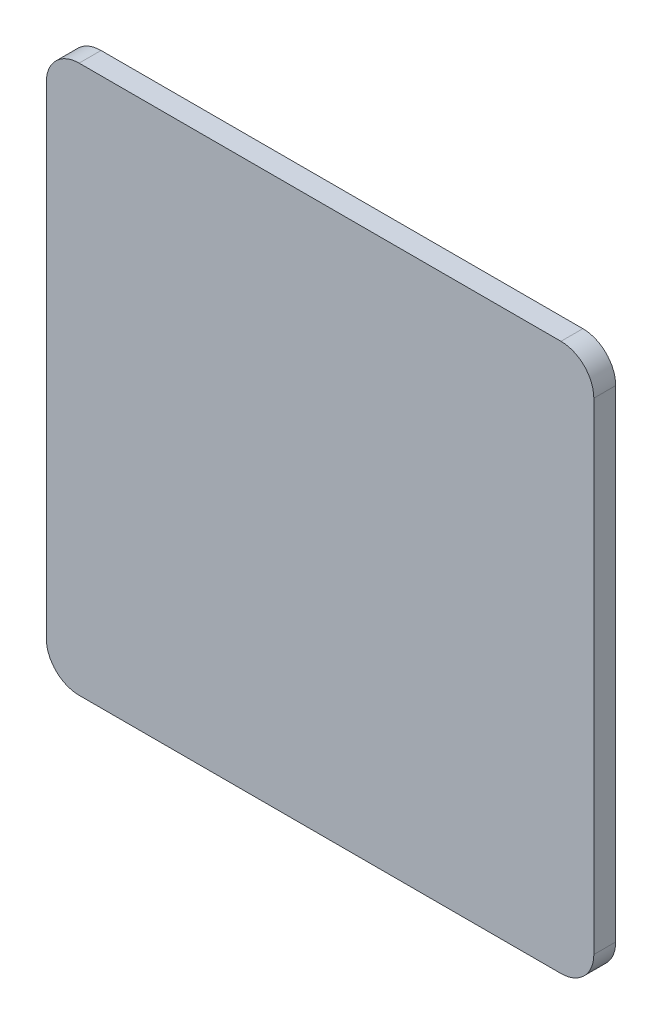
ISO-10303-21;
HEADER;
FILE_DESCRIPTION(('STEP AP214'),'2;1');
FILE_NAME('part.step','',(''),(''),'','','');
FILE_SCHEMA(('AUTOMOTIVE_DESIGN { 1 0 10303 214 1 1 1 1 }'));
ENDSEC;
DATA;
#1=APPLICATION_CONTEXT('core data for automotive mechanical design processes');
#2=APPLICATION_PROTOCOL_DEFINITION('international standard','automotive_design',2000,#1);
#3=PRODUCT_CONTEXT('',#1,'mechanical');
#4=PRODUCT('Part','Part','',(#3));
#5=PRODUCT_RELATED_PRODUCT_CATEGORY('part','',(#4));
#6=PRODUCT_DEFINITION_FORMATION('','',#4);
#7=PRODUCT_DEFINITION_CONTEXT('part definition',#1,'design');
#8=PRODUCT_DEFINITION('design','',#6,#7);
#9=PRODUCT_DEFINITION_SHAPE('','',#8);
#10=(LENGTH_UNIT() NAMED_UNIT(*) SI_UNIT(.MILLI.,.METRE.));
#11=(NAMED_UNIT(*) PLANE_ANGLE_UNIT() SI_UNIT($,.RADIAN.));
#12=(NAMED_UNIT(*) SI_UNIT($,.STERADIAN.) SOLID_ANGLE_UNIT());
#13=UNCERTAINTY_MEASURE_WITH_UNIT(LENGTH_MEASURE(1.E-05),#10,'distance_accuracy_value','');
#14=(GEOMETRIC_REPRESENTATION_CONTEXT(3) GLOBAL_UNCERTAINTY_ASSIGNED_CONTEXT((#13)) GLOBAL_UNIT_ASSIGNED_CONTEXT((#10,
#11,#12)) REPRESENTATION_CONTEXT('',''));
#15=CARTESIAN_POINT('',(0.,0.,0.));
#16=DIRECTION('',(0.,0.,1.));
#17=DIRECTION('',(1.,0.,0.));
#18=AXIS2_PLACEMENT_3D('',#15,#16,#17);
#19=CARTESIAN_POINT('',(-63.5,63.5,5.08));
#20=DIRECTION('',(1.,0.,0.));
#21=DIRECTION('',(0.,1.,0.));
#22=AXIS2_PLACEMENT_3D('',#19,#20,#21);
#23=PLANE('',#22);
#24=DIRECTION('',(0.,-1.,0.));
#25=VECTOR('',#24,1.);
#26=CARTESIAN_POINT('',(-63.5,63.5,0.));
#27=LINE('',#26,#25);
#28=CARTESIAN_POINT('',(-63.5,55.88,0.));
#29=VERTEX_POINT('',#28);
#30=CARTESIAN_POINT('',(-63.5,-55.88,0.));
#31=VERTEX_POINT('',#30);
#32=EDGE_CURVE('E130',#29,#31,#27,.T.);
#33=ORIENTED_EDGE('',*,*,#32,.T.);
#34=DIRECTION('',(0.,0.,-1.));
#35=VECTOR('',#34,1.);
#36=CARTESIAN_POINT('',(-63.5,-55.88,5.08));
#37=LINE('',#36,#35);
#38=CARTESIAN_POINT('',(-63.5,-55.88,5.08));
#39=VERTEX_POINT('',#38);
#40=EDGE_CURVE('E108',#31,#39,#37,.F.);
#41=ORIENTED_EDGE('',*,*,#40,.T.);
#42=DIRECTION('',(0.,-1.,0.));
#43=VECTOR('',#42,1.);
#44=CARTESIAN_POINT('',(-63.5,63.5,5.08));
#45=LINE('',#44,#43);
#46=CARTESIAN_POINT('',(-63.5,55.88,5.08));
#47=VERTEX_POINT('',#46);
#48=EDGE_CURVE('E139',#47,#39,#45,.T.);
#49=ORIENTED_EDGE('',*,*,#48,.F.);
#50=DIRECTION('',(0.,0.,-1.));
#51=VECTOR('',#50,1.);
#52=CARTESIAN_POINT('',(-63.5,55.88,5.08));
#53=LINE('',#52,#51);
#54=EDGE_CURVE('E113',#47,#29,#53,.T.);
#55=ORIENTED_EDGE('',*,*,#54,.T.);
#56=EDGE_LOOP('',(#33,#41,#49,#55));
#57=FACE_BOUND('',#56,.T.);
#58=ADVANCED_FACE('F37',(#57),#23,.F.);
#59=CARTESIAN_POINT('',(63.5,-63.5,5.08));
#60=DIRECTION('',(0.,1.,0.));
#61=DIRECTION('',(0.,0.,1.));
#62=AXIS2_PLACEMENT_3D('',#59,#60,#61);
#63=PLANE('',#62);
#64=DIRECTION('',(1.,0.,0.));
#65=VECTOR('',#64,1.);
#66=CARTESIAN_POINT('',(63.5,-63.5,5.08));
#67=LINE('',#66,#65);
#68=CARTESIAN_POINT('',(-55.88,-63.5,5.08));
#69=VERTEX_POINT('',#68);
#70=CARTESIAN_POINT('',(55.88,-63.5,5.08));
#71=VERTEX_POINT('',#70);
#72=EDGE_CURVE('E123',#69,#71,#67,.T.);
#73=ORIENTED_EDGE('',*,*,#72,.F.);
#74=DIRECTION('',(0.,0.,-1.));
#75=VECTOR('',#74,1.);
#76=CARTESIAN_POINT('',(-55.88,-63.5,5.08));
#77=LINE('',#76,#75);
#78=CARTESIAN_POINT('',(-55.88,-63.5,0.));
#79=VERTEX_POINT('',#78);
#80=EDGE_CURVE('E107',#69,#79,#77,.T.);
#81=ORIENTED_EDGE('',*,*,#80,.T.);
#82=DIRECTION('',(1.,0.,0.));
#83=VECTOR('',#82,1.);
#84=CARTESIAN_POINT('',(63.5,-63.5,0.));
#85=LINE('',#84,#83);
#86=CARTESIAN_POINT('',(55.88,-63.5,0.));
#87=VERTEX_POINT('',#86);
#88=EDGE_CURVE('E120',#79,#87,#85,.T.);
#89=ORIENTED_EDGE('',*,*,#88,.T.);
#90=DIRECTION('',(0.,0.,-1.));
#91=VECTOR('',#90,1.);
#92=CARTESIAN_POINT('',(55.88,-63.5,5.08));
#93=LINE('',#92,#91);
#94=EDGE_CURVE('E125',#87,#71,#93,.F.);
#95=ORIENTED_EDGE('',*,*,#94,.T.);
#96=EDGE_LOOP('',(#73,#81,#89,#95));
#97=FACE_BOUND('',#96,.T.);
#98=ADVANCED_FACE('F119',(#97),#63,.F.);
#99=CARTESIAN_POINT('',(63.5,63.5,5.08));
#100=DIRECTION('',(-1.,0.,0.));
#101=DIRECTION('',(0.,-1.,0.));
#102=AXIS2_PLACEMENT_3D('',#99,#100,#101);
#103=PLANE('',#102);
#104=DIRECTION('',(0.,1.,0.));
#105=VECTOR('',#104,1.);
#106=CARTESIAN_POINT('',(63.5,63.5,5.08));
#107=LINE('',#106,#105);
#108=CARTESIAN_POINT('',(63.5,-55.88,5.08));
#109=VERTEX_POINT('',#108);
#110=CARTESIAN_POINT('',(63.5,55.88,5.08));
#111=VERTEX_POINT('',#110);
#112=EDGE_CURVE('E165',#109,#111,#107,.T.);
#113=ORIENTED_EDGE('',*,*,#112,.F.);
#114=DIRECTION('',(0.,0.,-1.));
#115=VECTOR('',#114,1.);
#116=CARTESIAN_POINT('',(63.5,-55.88,5.08));
#117=LINE('',#116,#115);
#118=CARTESIAN_POINT('',(63.5,-55.88,0.));
#119=VERTEX_POINT('',#118);
#120=EDGE_CURVE('E158',#109,#119,#117,.T.);
#121=ORIENTED_EDGE('',*,*,#120,.T.);
#122=DIRECTION('',(0.,1.,0.));
#123=VECTOR('',#122,1.);
#124=CARTESIAN_POINT('',(63.5,63.5,0.));
#125=LINE('',#124,#123);
#126=CARTESIAN_POINT('',(63.5,55.88,0.));
#127=VERTEX_POINT('',#126);
#128=EDGE_CURVE('E129',#119,#127,#125,.T.);
#129=ORIENTED_EDGE('',*,*,#128,.T.);
#130=DIRECTION('',(0.,0.,-1.));
#131=VECTOR('',#130,1.);
#132=CARTESIAN_POINT('',(63.5,55.88,5.08));
#133=LINE('',#132,#131);
#134=EDGE_CURVE('E156',#127,#111,#133,.F.);
#135=ORIENTED_EDGE('',*,*,#134,.T.);
#136=EDGE_LOOP('',(#113,#121,#129,#135));
#137=FACE_BOUND('',#136,.T.);
#138=ADVANCED_FACE('F163',(#137),#103,.F.);
#139=CARTESIAN_POINT('',(63.5,63.5,5.08));
#140=DIRECTION('',(0.,-1.,0.));
#141=DIRECTION('',(0.,0.,-1.));
#142=AXIS2_PLACEMENT_3D('',#139,#140,#141);
#143=PLANE('',#142);
#144=DIRECTION('',(-1.,0.,0.));
#145=VECTOR('',#144,1.);
#146=CARTESIAN_POINT('',(63.5,63.5,5.08));
#147=LINE('',#146,#145);
#148=CARTESIAN_POINT('',(55.88,63.5,5.08));
#149=VERTEX_POINT('',#148);
#150=CARTESIAN_POINT('',(-55.88,63.5,5.08));
#151=VERTEX_POINT('',#150);
#152=EDGE_CURVE('E140',#149,#151,#147,.T.);
#153=ORIENTED_EDGE('',*,*,#152,.F.);
#154=DIRECTION('',(0.,0.,-1.));
#155=VECTOR('',#154,1.);
#156=CARTESIAN_POINT('',(55.88,63.5,5.08));
#157=LINE('',#156,#155);
#158=CARTESIAN_POINT('',(55.88,63.5,0.));
#159=VERTEX_POINT('',#158);
#160=EDGE_CURVE('E11',#149,#159,#157,.T.);
#161=ORIENTED_EDGE('',*,*,#160,.T.);
#162=DIRECTION('',(-1.,0.,0.));
#163=VECTOR('',#162,1.);
#164=CARTESIAN_POINT('',(63.5,63.5,0.));
#165=LINE('',#164,#163);
#166=CARTESIAN_POINT('',(-55.88,63.5,0.));
#167=VERTEX_POINT('',#166);
#168=EDGE_CURVE('E133',#159,#167,#165,.T.);
#169=ORIENTED_EDGE('',*,*,#168,.T.);
#170=DIRECTION('',(0.,0.,-1.));
#171=VECTOR('',#170,1.);
#172=CARTESIAN_POINT('',(-55.88,63.5,5.08));
#173=LINE('',#172,#171);
#174=EDGE_CURVE('E45',#167,#151,#173,.F.);
#175=ORIENTED_EDGE('',*,*,#174,.T.);
#176=EDGE_LOOP('',(#153,#161,#169,#175));
#177=FACE_BOUND('',#176,.T.);
#178=ADVANCED_FACE('F172',(#177),#143,.F.);
#179=CARTESIAN_POINT('',(0.,0.,5.08));
#180=DIRECTION('',(0.,0.,-1.));
#181=DIRECTION('',(-1.,0.,0.));
#182=AXIS2_PLACEMENT_3D('',#179,#180,#181);
#183=PLANE('',#182);
#184=ORIENTED_EDGE('',*,*,#48,.T.);
#185=CARTESIAN_POINT('',(-55.88,-55.88,5.08));
#186=DIRECTION('',(0.,0.,-1.));
#187=DIRECTION('',(-1.,0.,0.));
#188=AXIS2_PLACEMENT_3D('',#185,#186,#187);
#189=CIRCLE('',#188,7.62);
#190=EDGE_CURVE('E154',#39,#69,#189,.F.);
#191=ORIENTED_EDGE('',*,*,#190,.T.);
#192=ORIENTED_EDGE('',*,*,#72,.T.);
#193=CARTESIAN_POINT('',(55.88,-55.88,5.08));
#194=DIRECTION('',(0.,0.,-1.));
#195=DIRECTION('',(-1.,0.,0.));
#196=AXIS2_PLACEMENT_3D('',#193,#194,#195);
#197=CIRCLE('',#196,7.62);
#198=EDGE_CURVE('E152',#71,#109,#197,.F.);
#199=ORIENTED_EDGE('',*,*,#198,.T.);
#200=ORIENTED_EDGE('',*,*,#112,.T.);
#201=CARTESIAN_POINT('',(55.88,55.88,5.08));
#202=DIRECTION('',(0.,0.,-1.));
#203=DIRECTION('',(-1.,0.,0.));
#204=AXIS2_PLACEMENT_3D('',#201,#202,#203);
#205=CIRCLE('',#204,7.62);
#206=EDGE_CURVE('E58',#111,#149,#205,.F.);
#207=ORIENTED_EDGE('',*,*,#206,.T.);
#208=ORIENTED_EDGE('',*,*,#152,.T.);
#209=CARTESIAN_POINT('',(-55.88,55.88,5.08));
#210=DIRECTION('',(0.,0.,-1.));
#211=DIRECTION('',(-1.,0.,0.));
#212=AXIS2_PLACEMENT_3D('',#209,#210,#211);
#213=CIRCLE('',#212,7.62);
#214=EDGE_CURVE('E149',#151,#47,#213,.F.);
#215=ORIENTED_EDGE('',*,*,#214,.T.);
#216=EDGE_LOOP('',(#184,#191,#192,#199,#200,#207,#208,#215));
#217=FACE_BOUND('',#216,.T.);
#218=ADVANCED_FACE('F179',(#217),#183,.F.);
#219=CARTESIAN_POINT('',(0.,0.,0.));
#220=DIRECTION('',(0.,0.,-1.));
#221=DIRECTION('',(-1.,0.,0.));
#222=AXIS2_PLACEMENT_3D('',#219,#220,#221);
#223=PLANE('',#222);
#224=ORIENTED_EDGE('',*,*,#88,.F.);
#225=CARTESIAN_POINT('',(-55.88,-55.88,0.));
#226=DIRECTION('',(0.,0.,-1.));
#227=DIRECTION('',(-1.,0.,0.));
#228=AXIS2_PLACEMENT_3D('',#225,#226,#227);
#229=CIRCLE('',#228,7.62);
#230=EDGE_CURVE('E103',#79,#31,#229,.T.);
#231=ORIENTED_EDGE('',*,*,#230,.T.);
#232=ORIENTED_EDGE('',*,*,#32,.F.);
#233=CARTESIAN_POINT('',(-55.88,55.88,0.));
#234=DIRECTION('',(0.,0.,-1.));
#235=DIRECTION('',(-1.,0.,0.));
#236=AXIS2_PLACEMENT_3D('',#233,#234,#235);
#237=CIRCLE('',#236,7.62);
#238=EDGE_CURVE('E124',#29,#167,#237,.T.);
#239=ORIENTED_EDGE('',*,*,#238,.T.);
#240=ORIENTED_EDGE('',*,*,#168,.F.);
#241=CARTESIAN_POINT('',(55.88,55.88,0.));
#242=DIRECTION('',(0.,0.,-1.));
#243=DIRECTION('',(-1.,0.,0.));
#244=AXIS2_PLACEMENT_3D('',#241,#242,#243);
#245=CIRCLE('',#244,7.62);
#246=EDGE_CURVE('E143',#159,#127,#245,.T.);
#247=ORIENTED_EDGE('',*,*,#246,.T.);
#248=ORIENTED_EDGE('',*,*,#128,.F.);
#249=CARTESIAN_POINT('',(55.88,-55.88,0.));
#250=DIRECTION('',(0.,0.,-1.));
#251=DIRECTION('',(-1.,0.,0.));
#252=AXIS2_PLACEMENT_3D('',#249,#250,#251);
#253=CIRCLE('',#252,7.62);
#254=EDGE_CURVE('E114',#119,#87,#253,.T.);
#255=ORIENTED_EDGE('',*,*,#254,.T.);
#256=EDGE_LOOP('',(#224,#231,#232,#239,#240,#247,#248,#255));
#257=FACE_BOUND('',#256,.T.);
#258=ADVANCED_FACE('F127',(#257),#223,.T.);
#259=CARTESIAN_POINT('',(-55.88,-55.88,5.08));
#260=DIRECTION('',(0.,0.,-1.));
#261=DIRECTION('',(-1.,0.,0.));
#262=AXIS2_PLACEMENT_3D('',#259,#260,#261);
#263=CYLINDRICAL_SURFACE('',#262,7.62);
#264=ORIENTED_EDGE('',*,*,#190,.F.);
#265=ORIENTED_EDGE('',*,*,#40,.F.);
#266=ORIENTED_EDGE('',*,*,#230,.F.);
#267=ORIENTED_EDGE('',*,*,#80,.F.);
#268=EDGE_LOOP('',(#264,#265,#266,#267));
#269=FACE_BOUND('',#268,.T.);
#270=ADVANCED_FACE('F106',(#269),#263,.T.);
#271=CARTESIAN_POINT('',(55.88,-55.88,5.08));
#272=DIRECTION('',(0.,0.,-1.));
#273=DIRECTION('',(-1.,0.,0.));
#274=AXIS2_PLACEMENT_3D('',#271,#272,#273);
#275=CYLINDRICAL_SURFACE('',#274,7.62);
#276=ORIENTED_EDGE('',*,*,#198,.F.);
#277=ORIENTED_EDGE('',*,*,#94,.F.);
#278=ORIENTED_EDGE('',*,*,#254,.F.);
#279=ORIENTED_EDGE('',*,*,#120,.F.);
#280=EDGE_LOOP('',(#276,#277,#278,#279));
#281=FACE_BOUND('',#280,.T.);
#282=ADVANCED_FACE('F187',(#281),#275,.T.);
#283=CARTESIAN_POINT('',(55.88,55.88,5.08));
#284=DIRECTION('',(0.,0.,-1.));
#285=DIRECTION('',(-1.,0.,0.));
#286=AXIS2_PLACEMENT_3D('',#283,#284,#285);
#287=CYLINDRICAL_SURFACE('',#286,7.62);
#288=ORIENTED_EDGE('',*,*,#206,.F.);
#289=ORIENTED_EDGE('',*,*,#134,.F.);
#290=ORIENTED_EDGE('',*,*,#246,.F.);
#291=ORIENTED_EDGE('',*,*,#160,.F.);
#292=EDGE_LOOP('',(#288,#289,#290,#291));
#293=FACE_BOUND('',#292,.T.);
#294=ADVANCED_FACE('F171',(#293),#287,.T.);
#295=CARTESIAN_POINT('',(-55.88,55.88,5.08));
#296=DIRECTION('',(0.,0.,-1.));
#297=DIRECTION('',(-1.,0.,0.));
#298=AXIS2_PLACEMENT_3D('',#295,#296,#297);
#299=CYLINDRICAL_SURFACE('',#298,7.62);
#300=ORIENTED_EDGE('',*,*,#214,.F.);
#301=ORIENTED_EDGE('',*,*,#174,.F.);
#302=ORIENTED_EDGE('',*,*,#238,.F.);
#303=ORIENTED_EDGE('',*,*,#54,.F.);
#304=EDGE_LOOP('',(#300,#301,#302,#303));
#305=FACE_BOUND('',#304,.T.);
#306=ADVANCED_FACE('F39',(#305),#299,.T.);
#307=CLOSED_SHELL('',(#58,#98,#138,#178,#218,#258,#270,#282,#294,#306));
#308=MANIFOLD_SOLID_BREP('B2',#307);
#309=ADVANCED_BREP_SHAPE_REPRESENTATION('',(#18,#308),#14);
#310=SHAPE_DEFINITION_REPRESENTATION(#9,#309);
ENDSEC;
END-ISO-10303-21;
